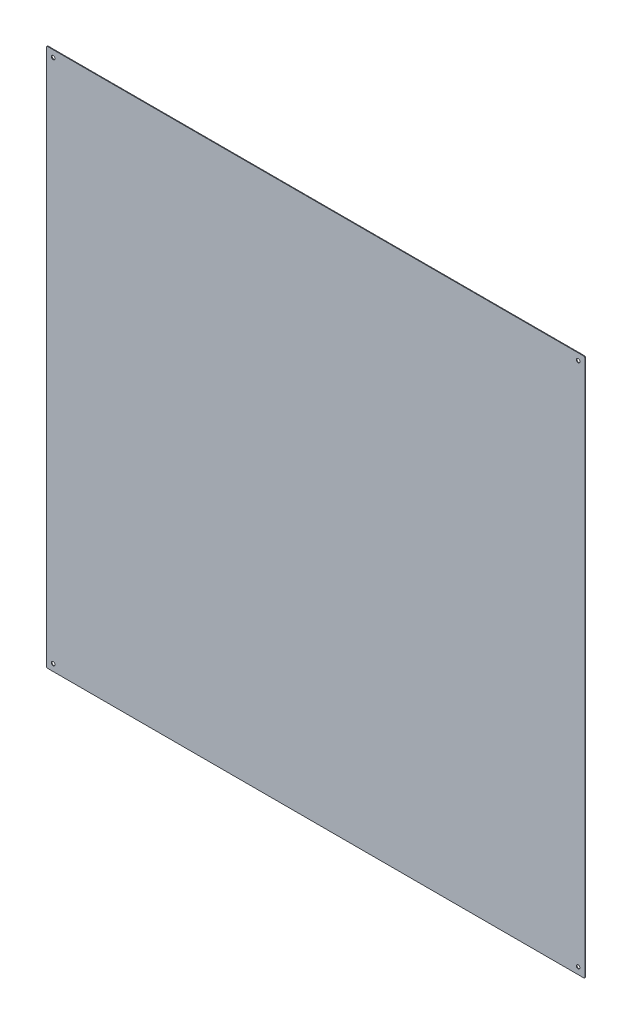
ISO-10303-21;
HEADER;
FILE_DESCRIPTION(('STEP AP214'),'2;1');
FILE_NAME('part.step','',(''),(''),'','','');
FILE_SCHEMA(('AUTOMOTIVE_DESIGN { 1 0 10303 214 1 1 1 1 }'));
ENDSEC;
DATA;
#1=APPLICATION_CONTEXT('core data for automotive mechanical design processes');
#2=APPLICATION_PROTOCOL_DEFINITION('international standard','automotive_design',2000,#1);
#3=PRODUCT_CONTEXT('',#1,'mechanical');
#4=PRODUCT('Part','Part','',(#3));
#5=PRODUCT_RELATED_PRODUCT_CATEGORY('part','',(#4));
#6=PRODUCT_DEFINITION_FORMATION('','',#4);
#7=PRODUCT_DEFINITION_CONTEXT('part definition',#1,'design');
#8=PRODUCT_DEFINITION('design','',#6,#7);
#9=PRODUCT_DEFINITION_SHAPE('','',#8);
#10=(LENGTH_UNIT() NAMED_UNIT(*) SI_UNIT(.MILLI.,.METRE.));
#11=(NAMED_UNIT(*) PLANE_ANGLE_UNIT() SI_UNIT($,.RADIAN.));
#12=(NAMED_UNIT(*) SI_UNIT($,.STERADIAN.) SOLID_ANGLE_UNIT());
#13=UNCERTAINTY_MEASURE_WITH_UNIT(LENGTH_MEASURE(1.E-05),#10,'distance_accuracy_value','');
#14=(GEOMETRIC_REPRESENTATION_CONTEXT(3) GLOBAL_UNCERTAINTY_ASSIGNED_CONTEXT((#13)) GLOBAL_UNIT_ASSIGNED_CONTEXT((#10,
#11,#12)) REPRESENTATION_CONTEXT('',''));
#15=CARTESIAN_POINT('',(0.,0.,0.));
#16=DIRECTION('',(0.,0.,1.));
#17=DIRECTION('',(1.,0.,0.));
#18=AXIS2_PLACEMENT_3D('',#15,#16,#17);
#19=CARTESIAN_POINT('',(602.500000000001,602.5,7.50000000000006));
#20=DIRECTION('',(-1.,0.,0.));
#21=DIRECTION('',(0.,-1.,0.));
#22=AXIS2_PLACEMENT_3D('',#19,#20,#21);
#23=PLANE('',#22);
#24=DIRECTION('',(0.,1.,0.));
#25=VECTOR('',#24,1.);
#26=CARTESIAN_POINT('',(602.500000000001,602.5,6.00000000000001));
#27=LINE('',#26,#25);
#28=CARTESIAN_POINT('',(602.500000000001,-599.5,6.00000000000001));
#29=VERTEX_POINT('',#28);
#30=CARTESIAN_POINT('',(602.500000000001,599.5,6.00000000000001));
#31=VERTEX_POINT('',#30);
#32=EDGE_CURVE('E131',#29,#31,#27,.T.);
#33=ORIENTED_EDGE('',*,*,#32,.T.);
#34=DIRECTION('',(0.,0.,-1.));
#35=VECTOR('',#34,1.);
#36=CARTESIAN_POINT('',(602.500000000001,599.5,7.50000000000006));
#37=LINE('',#36,#35);
#38=CARTESIAN_POINT('',(602.500000000001,599.5,7.50000000000006));
#39=VERTEX_POINT('',#38);
#40=EDGE_CURVE('E154',#31,#39,#37,.F.);
#41=ORIENTED_EDGE('',*,*,#40,.T.);
#42=DIRECTION('',(0.,1.,0.));
#43=VECTOR('',#42,1.);
#44=CARTESIAN_POINT('',(602.500000000001,602.5,7.50000000000006));
#45=LINE('',#44,#43);
#46=CARTESIAN_POINT('',(602.500000000001,-599.5,7.50000000000006));
#47=VERTEX_POINT('',#46);
#48=EDGE_CURVE('E129',#47,#39,#45,.T.);
#49=ORIENTED_EDGE('',*,*,#48,.F.);
#50=DIRECTION('',(0.,0.,-1.));
#51=VECTOR('',#50,1.);
#52=CARTESIAN_POINT('',(602.500000000001,-599.5,7.50000000000006));
#53=LINE('',#52,#51);
#54=EDGE_CURVE('E151',#47,#29,#53,.T.);
#55=ORIENTED_EDGE('',*,*,#54,.T.);
#56=EDGE_LOOP('',(#33,#41,#49,#55));
#57=FACE_BOUND('',#56,.T.);
#58=ADVANCED_FACE('F36',(#57),#23,.F.);
#59=CARTESIAN_POINT('',(-602.5,602.5,7.50000000000006));
#60=DIRECTION('',(0.,-1.,0.));
#61=DIRECTION('',(1.,0.,0.));
#62=AXIS2_PLACEMENT_3D('',#59,#60,#61);
#63=PLANE('',#62);
#64=DIRECTION('',(-1.,0.,0.));
#65=VECTOR('',#64,1.);
#66=CARTESIAN_POINT('',(-602.5,602.5,6.00000000000001));
#67=LINE('',#66,#65);
#68=CARTESIAN_POINT('',(599.500000000001,602.5,6.00000000000001));
#69=VERTEX_POINT('',#68);
#70=CARTESIAN_POINT('',(-599.5,602.5,6.00000000000001));
#71=VERTEX_POINT('',#70);
#72=EDGE_CURVE('E127',#69,#71,#67,.T.);
#73=ORIENTED_EDGE('',*,*,#72,.T.);
#74=DIRECTION('',(0.,0.,-1.));
#75=VECTOR('',#74,1.);
#76=CARTESIAN_POINT('',(-599.5,602.5,7.50000000000006));
#77=LINE('',#76,#75);
#78=CARTESIAN_POINT('',(-599.5,602.5,7.50000000000006));
#79=VERTEX_POINT('',#78);
#80=EDGE_CURVE('E106',#71,#79,#77,.F.);
#81=ORIENTED_EDGE('',*,*,#80,.T.);
#82=DIRECTION('',(-1.,0.,0.));
#83=VECTOR('',#82,1.);
#84=CARTESIAN_POINT('',(-602.5,602.5,7.50000000000006));
#85=LINE('',#84,#83);
#86=CARTESIAN_POINT('',(599.500000000001,602.5,7.50000000000006));
#87=VERTEX_POINT('',#86);
#88=EDGE_CURVE('E170',#87,#79,#85,.T.);
#89=ORIENTED_EDGE('',*,*,#88,.F.);
#90=DIRECTION('',(0.,0.,-1.));
#91=VECTOR('',#90,1.);
#92=CARTESIAN_POINT('',(599.500000000001,602.5,7.50000000000006));
#93=LINE('',#92,#91);
#94=EDGE_CURVE('E111',#87,#69,#93,.T.);
#95=ORIENTED_EDGE('',*,*,#94,.T.);
#96=EDGE_LOOP('',(#73,#81,#89,#95));
#97=FACE_BOUND('',#96,.T.);
#98=ADVANCED_FACE('F229',(#97),#63,.F.);
#99=CARTESIAN_POINT('',(-602.5,602.5,7.50000000000006));
#100=DIRECTION('',(1.,0.,0.));
#101=DIRECTION('',(0.,1.,0.));
#102=AXIS2_PLACEMENT_3D('',#99,#100,#101);
#103=PLANE('',#102);
#104=DIRECTION('',(0.,-1.,0.));
#105=VECTOR('',#104,1.);
#106=CARTESIAN_POINT('',(-602.5,602.5,7.50000000000006));
#107=LINE('',#106,#105);
#108=CARTESIAN_POINT('',(-602.5,599.5,7.50000000000006));
#109=VERTEX_POINT('',#108);
#110=CARTESIAN_POINT('',(-602.499999999999,-599.5,7.50000000000006));
#111=VERTEX_POINT('',#110);
#112=EDGE_CURVE('E120',#109,#111,#107,.T.);
#113=ORIENTED_EDGE('',*,*,#112,.F.);
#114=DIRECTION('',(0.,0.,-1.));
#115=VECTOR('',#114,1.);
#116=CARTESIAN_POINT('',(-602.5,599.5,7.50000000000006));
#117=LINE('',#116,#115);
#118=CARTESIAN_POINT('',(-602.5,599.5,6.00000000000001));
#119=VERTEX_POINT('',#118);
#120=EDGE_CURVE('E105',#109,#119,#117,.T.);
#121=ORIENTED_EDGE('',*,*,#120,.T.);
#122=DIRECTION('',(0.,-1.,0.));
#123=VECTOR('',#122,1.);
#124=CARTESIAN_POINT('',(-602.5,602.5,6.00000000000001));
#125=LINE('',#124,#123);
#126=CARTESIAN_POINT('',(-602.499999999999,-599.5,6.00000000000001));
#127=VERTEX_POINT('',#126);
#128=EDGE_CURVE('E118',#119,#127,#125,.T.);
#129=ORIENTED_EDGE('',*,*,#128,.T.);
#130=DIRECTION('',(0.,0.,-1.));
#131=VECTOR('',#130,1.);
#132=CARTESIAN_POINT('',(-602.499999999999,-599.5,7.50000000000006));
#133=LINE('',#132,#131);
#134=EDGE_CURVE('E122',#127,#111,#133,.F.);
#135=ORIENTED_EDGE('',*,*,#134,.T.);
#136=EDGE_LOOP('',(#113,#121,#129,#135));
#137=FACE_BOUND('',#136,.T.);
#138=ADVANCED_FACE('F117',(#137),#103,.F.);
#139=CARTESIAN_POINT('',(-602.499999999999,-602.5,7.50000000000006));
#140=DIRECTION('',(0.,1.,0.));
#141=DIRECTION('',(0.,0.,1.));
#142=AXIS2_PLACEMENT_3D('',#139,#140,#141);
#143=PLANE('',#142);
#144=DIRECTION('',(1.,0.,0.));
#145=VECTOR('',#144,1.);
#146=CARTESIAN_POINT('',(-602.499999999999,-602.5,6.00000000000001));
#147=LINE('',#146,#145);
#148=CARTESIAN_POINT('',(-599.499999999999,-602.5,6.00000000000001));
#149=VERTEX_POINT('',#148);
#150=CARTESIAN_POINT('',(599.500000000001,-602.5,6.00000000000001));
#151=VERTEX_POINT('',#150);
#152=EDGE_CURVE('E126',#149,#151,#147,.T.);
#153=ORIENTED_EDGE('',*,*,#152,.T.);
#154=DIRECTION('',(0.,0.,-1.));
#155=VECTOR('',#154,1.);
#156=CARTESIAN_POINT('',(599.500000000001,-602.5,7.50000000000006));
#157=LINE('',#156,#155);
#158=CARTESIAN_POINT('',(599.500000000001,-602.5,7.50000000000006));
#159=VERTEX_POINT('',#158);
#160=EDGE_CURVE('E11',#151,#159,#157,.F.);
#161=ORIENTED_EDGE('',*,*,#160,.T.);
#162=DIRECTION('',(1.,0.,0.));
#163=VECTOR('',#162,1.);
#164=CARTESIAN_POINT('',(-602.499999999999,-602.5,7.50000000000006));
#165=LINE('',#164,#163);
#166=CARTESIAN_POINT('',(-599.499999999999,-602.5,7.50000000000006));
#167=VERTEX_POINT('',#166);
#168=EDGE_CURVE('E135',#167,#159,#165,.T.);
#169=ORIENTED_EDGE('',*,*,#168,.F.);
#170=DIRECTION('',(0.,0.,-1.));
#171=VECTOR('',#170,1.);
#172=CARTESIAN_POINT('',(-599.499999999999,-602.5,7.50000000000006));
#173=LINE('',#172,#171);
#174=EDGE_CURVE('E44',#167,#149,#173,.T.);
#175=ORIENTED_EDGE('',*,*,#174,.T.);
#176=EDGE_LOOP('',(#153,#161,#169,#175));
#177=FACE_BOUND('',#176,.T.);
#178=ADVANCED_FACE('F157',(#177),#143,.F.);
#179=CARTESIAN_POINT('',(0.,0.,7.50000000000006));
#180=DIRECTION('',(0.,0.,1.));
#181=DIRECTION('',(1.,0.,0.));
#182=AXIS2_PLACEMENT_3D('',#179,#180,#181);
#183=PLANE('',#182);
#184=CARTESIAN_POINT('',(-587.322330470337,587.322330470336,7.50000000000006));
#185=DIRECTION('',(0.,0.,-1.));
#186=DIRECTION('',(-1.,0.,0.));
#187=AXIS2_PLACEMENT_3D('',#184,#185,#186);
#188=CIRCLE('',#187,3.99999999999999);
#189=CARTESIAN_POINT('',(-591.322330470337,587.322330470336,7.50000000000006));
#190=VERTEX_POINT('',#189);
#191=EDGE_CURVE('E189',#190,#190,#188,.T.);
#192=ORIENTED_EDGE('',*,*,#191,.T.);
#193=EDGE_LOOP('',(#192));
#194=FACE_BOUND('',#193,.T.);
#195=CARTESIAN_POINT('',(587.32233047033,587.322330470342,7.50000000000006));
#196=DIRECTION('',(0.,0.,-1.));
#197=DIRECTION('',(-1.,0.,0.));
#198=AXIS2_PLACEMENT_3D('',#195,#196,#197);
#199=CIRCLE('',#198,3.99999999999999);
#200=CARTESIAN_POINT('',(583.32233047033,587.322330470342,7.50000000000006));
#201=VERTEX_POINT('',#200);
#202=EDGE_CURVE('E195',#201,#201,#199,.T.);
#203=ORIENTED_EDGE('',*,*,#202,.T.);
#204=EDGE_LOOP('',(#203));
#205=FACE_BOUND('',#204,.T.);
#206=CARTESIAN_POINT('',(587.32233047034,-587.322330470332,7.50000000000006));
#207=DIRECTION('',(0.,0.,-1.));
#208=DIRECTION('',(-1.,0.,0.));
#209=AXIS2_PLACEMENT_3D('',#206,#207,#208);
#210=CIRCLE('',#209,3.99999999999999);
#211=CARTESIAN_POINT('',(583.32233047034,-587.322330470332,7.50000000000006));
#212=VERTEX_POINT('',#211);
#213=EDGE_CURVE('E184',#212,#212,#210,.T.);
#214=ORIENTED_EDGE('',*,*,#213,.T.);
#215=EDGE_LOOP('',(#214));
#216=FACE_BOUND('',#215,.T.);
#217=CARTESIAN_POINT('',(-587.322330470334,-587.322330470338,7.50000000000006));
#218=DIRECTION('',(0.,0.,-1.));
#219=DIRECTION('',(-1.,0.,0.));
#220=AXIS2_PLACEMENT_3D('',#217,#218,#219);
#221=CIRCLE('',#220,3.99999999999999);
#222=CARTESIAN_POINT('',(-591.322330470334,-587.322330470338,7.50000000000006));
#223=VERTEX_POINT('',#222);
#224=EDGE_CURVE('E179',#223,#223,#221,.T.);
#225=ORIENTED_EDGE('',*,*,#224,.T.);
#226=EDGE_LOOP('',(#225));
#227=FACE_BOUND('',#226,.T.);
#228=ORIENTED_EDGE('',*,*,#88,.T.);
#229=CARTESIAN_POINT('',(-599.5,599.5,7.50000000000006));
#230=DIRECTION('',(0.,0.,1.));
#231=DIRECTION('',(1.,0.,0.));
#232=AXIS2_PLACEMENT_3D('',#229,#230,#231);
#233=CIRCLE('',#232,3.);
#234=EDGE_CURVE('E149',#79,#109,#233,.T.);
#235=ORIENTED_EDGE('',*,*,#234,.T.);
#236=ORIENTED_EDGE('',*,*,#112,.T.);
#237=CARTESIAN_POINT('',(-599.499999999999,-599.5,7.50000000000006));
#238=DIRECTION('',(0.,0.,1.));
#239=DIRECTION('',(1.,0.,0.));
#240=AXIS2_PLACEMENT_3D('',#237,#238,#239);
#241=CIRCLE('',#240,3.);
#242=EDGE_CURVE('E56',#111,#167,#241,.T.);
#243=ORIENTED_EDGE('',*,*,#242,.T.);
#244=ORIENTED_EDGE('',*,*,#168,.T.);
#245=CARTESIAN_POINT('',(599.500000000001,-599.5,7.50000000000006));
#246=DIRECTION('',(0.,0.,1.));
#247=DIRECTION('',(1.,0.,0.));
#248=AXIS2_PLACEMENT_3D('',#245,#246,#247);
#249=CIRCLE('',#248,3.);
#250=EDGE_CURVE('E145',#159,#47,#249,.T.);
#251=ORIENTED_EDGE('',*,*,#250,.T.);
#252=ORIENTED_EDGE('',*,*,#48,.T.);
#253=CARTESIAN_POINT('',(599.500000000001,599.5,7.50000000000006));
#254=DIRECTION('',(0.,0.,1.));
#255=DIRECTION('',(1.,0.,0.));
#256=AXIS2_PLACEMENT_3D('',#253,#254,#255);
#257=CIRCLE('',#256,3.);
#258=EDGE_CURVE('E147',#39,#87,#257,.T.);
#259=ORIENTED_EDGE('',*,*,#258,.T.);
#260=EDGE_LOOP('',(#228,#235,#236,#243,#244,#251,#252,#259));
#261=FACE_BOUND('',#260,.T.);
#262=ADVANCED_FACE('F204',(#194,#205,#216,#227,#261),#183,.T.);
#263=CARTESIAN_POINT('',(0.,0.,6.00000000000001));
#264=DIRECTION('',(0.,0.,1.));
#265=DIRECTION('',(1.,0.,0.));
#266=AXIS2_PLACEMENT_3D('',#263,#264,#265);
#267=PLANE('',#266);
#268=CARTESIAN_POINT('',(-587.322330470337,587.322330470336,6.00000000000001));
#269=DIRECTION('',(0.,0.,-1.));
#270=DIRECTION('',(-1.,0.,0.));
#271=AXIS2_PLACEMENT_3D('',#268,#269,#270);
#272=CIRCLE('',#271,3.99999999999999);
#273=CARTESIAN_POINT('',(-591.322330470337,587.322330470336,6.00000000000001));
#274=VERTEX_POINT('',#273);
#275=EDGE_CURVE('E186',#274,#274,#272,.T.);
#276=ORIENTED_EDGE('',*,*,#275,.F.);
#277=EDGE_LOOP('',(#276));
#278=FACE_BOUND('',#277,.T.);
#279=CARTESIAN_POINT('',(587.32233047033,587.322330470342,6.00000000000001));
#280=DIRECTION('',(0.,0.,-1.));
#281=DIRECTION('',(-1.,0.,0.));
#282=AXIS2_PLACEMENT_3D('',#279,#280,#281);
#283=CIRCLE('',#282,3.99999999999999);
#284=CARTESIAN_POINT('',(583.32233047033,587.322330470342,6.00000000000001));
#285=VERTEX_POINT('',#284);
#286=EDGE_CURVE('E192',#285,#285,#283,.T.);
#287=ORIENTED_EDGE('',*,*,#286,.F.);
#288=EDGE_LOOP('',(#287));
#289=FACE_BOUND('',#288,.T.);
#290=CARTESIAN_POINT('',(587.32233047034,-587.322330470332,6.00000000000001));
#291=DIRECTION('',(0.,0.,-1.));
#292=DIRECTION('',(-1.,0.,0.));
#293=AXIS2_PLACEMENT_3D('',#290,#291,#292);
#294=CIRCLE('',#293,3.99999999999999);
#295=CARTESIAN_POINT('',(583.32233047034,-587.322330470332,6.00000000000001));
#296=VERTEX_POINT('',#295);
#297=EDGE_CURVE('E198',#296,#296,#294,.T.);
#298=ORIENTED_EDGE('',*,*,#297,.F.);
#299=EDGE_LOOP('',(#298));
#300=FACE_BOUND('',#299,.T.);
#301=CARTESIAN_POINT('',(-587.322330470334,-587.322330470338,6.00000000000001));
#302=DIRECTION('',(0.,0.,-1.));
#303=DIRECTION('',(-1.,0.,0.));
#304=AXIS2_PLACEMENT_3D('',#301,#302,#303);
#305=CIRCLE('',#304,3.99999999999999);
#306=CARTESIAN_POINT('',(-591.322330470334,-587.322330470338,6.00000000000001));
#307=VERTEX_POINT('',#306);
#308=EDGE_CURVE('E175',#307,#307,#305,.T.);
#309=ORIENTED_EDGE('',*,*,#308,.F.);
#310=EDGE_LOOP('',(#309));
#311=FACE_BOUND('',#310,.T.);
#312=ORIENTED_EDGE('',*,*,#128,.F.);
#313=CARTESIAN_POINT('',(-599.5,599.5,6.00000000000001));
#314=DIRECTION('',(0.,0.,1.));
#315=DIRECTION('',(1.,0.,0.));
#316=AXIS2_PLACEMENT_3D('',#313,#314,#315);
#317=CIRCLE('',#316,3.);
#318=EDGE_CURVE('E101',#119,#71,#317,.F.);
#319=ORIENTED_EDGE('',*,*,#318,.T.);
#320=ORIENTED_EDGE('',*,*,#72,.F.);
#321=CARTESIAN_POINT('',(599.500000000001,599.5,6.00000000000001));
#322=DIRECTION('',(0.,0.,1.));
#323=DIRECTION('',(1.,0.,0.));
#324=AXIS2_PLACEMENT_3D('',#321,#322,#323);
#325=CIRCLE('',#324,3.);
#326=EDGE_CURVE('E112',#69,#31,#325,.F.);
#327=ORIENTED_EDGE('',*,*,#326,.T.);
#328=ORIENTED_EDGE('',*,*,#32,.F.);
#329=CARTESIAN_POINT('',(599.500000000001,-599.5,6.00000000000001));
#330=DIRECTION('',(0.,0.,1.));
#331=DIRECTION('',(1.,0.,0.));
#332=AXIS2_PLACEMENT_3D('',#329,#330,#331);
#333=CIRCLE('',#332,3.);
#334=EDGE_CURVE('E138',#29,#151,#333,.F.);
#335=ORIENTED_EDGE('',*,*,#334,.T.);
#336=ORIENTED_EDGE('',*,*,#152,.F.);
#337=CARTESIAN_POINT('',(-599.499999999999,-599.5,6.00000000000001));
#338=DIRECTION('',(0.,0.,1.));
#339=DIRECTION('',(1.,0.,0.));
#340=AXIS2_PLACEMENT_3D('',#337,#338,#339);
#341=CIRCLE('',#340,3.);
#342=EDGE_CURVE('E121',#149,#127,#341,.F.);
#343=ORIENTED_EDGE('',*,*,#342,.T.);
#344=EDGE_LOOP('',(#312,#319,#320,#327,#328,#335,#336,#343));
#345=FACE_BOUND('',#344,.T.);
#346=ADVANCED_FACE('F124',(#278,#289,#300,#311,#345),#267,.F.);
#347=CARTESIAN_POINT('',(-599.5,599.5,7.50000000000006));
#348=DIRECTION('',(0.,0.,-1.));
#349=DIRECTION('',(-1.,0.,0.));
#350=AXIS2_PLACEMENT_3D('',#347,#348,#349);
#351=CYLINDRICAL_SURFACE('',#350,3.);
#352=ORIENTED_EDGE('',*,*,#234,.F.);
#353=ORIENTED_EDGE('',*,*,#80,.F.);
#354=ORIENTED_EDGE('',*,*,#318,.F.);
#355=ORIENTED_EDGE('',*,*,#120,.F.);
#356=EDGE_LOOP('',(#352,#353,#354,#355));
#357=FACE_BOUND('',#356,.T.);
#358=ADVANCED_FACE('F104',(#357),#351,.T.);
#359=CARTESIAN_POINT('',(599.500000000001,599.5,7.50000000000006));
#360=DIRECTION('',(0.,0.,-1.));
#361=DIRECTION('',(-1.,0.,0.));
#362=AXIS2_PLACEMENT_3D('',#359,#360,#361);
#363=CYLINDRICAL_SURFACE('',#362,3.);
#364=ORIENTED_EDGE('',*,*,#258,.F.);
#365=ORIENTED_EDGE('',*,*,#40,.F.);
#366=ORIENTED_EDGE('',*,*,#326,.F.);
#367=ORIENTED_EDGE('',*,*,#94,.F.);
#368=EDGE_LOOP('',(#364,#365,#366,#367));
#369=FACE_BOUND('',#368,.T.);
#370=ADVANCED_FACE('F240',(#369),#363,.T.);
#371=CARTESIAN_POINT('',(599.500000000001,-599.5,7.50000000000006));
#372=DIRECTION('',(0.,0.,-1.));
#373=DIRECTION('',(-1.,0.,0.));
#374=AXIS2_PLACEMENT_3D('',#371,#372,#373);
#375=CYLINDRICAL_SURFACE('',#374,3.);
#376=ORIENTED_EDGE('',*,*,#250,.F.);
#377=ORIENTED_EDGE('',*,*,#160,.F.);
#378=ORIENTED_EDGE('',*,*,#334,.F.);
#379=ORIENTED_EDGE('',*,*,#54,.F.);
#380=EDGE_LOOP('',(#376,#377,#378,#379));
#381=FACE_BOUND('',#380,.T.);
#382=ADVANCED_FACE('F164',(#381),#375,.T.);
#383=CARTESIAN_POINT('',(-599.499999999999,-599.5,7.50000000000006));
#384=DIRECTION('',(0.,0.,-1.));
#385=DIRECTION('',(-1.,0.,0.));
#386=AXIS2_PLACEMENT_3D('',#383,#384,#385);
#387=CYLINDRICAL_SURFACE('',#386,3.);
#388=ORIENTED_EDGE('',*,*,#242,.F.);
#389=ORIENTED_EDGE('',*,*,#134,.F.);
#390=ORIENTED_EDGE('',*,*,#342,.F.);
#391=ORIENTED_EDGE('',*,*,#174,.F.);
#392=EDGE_LOOP('',(#388,#389,#390,#391));
#393=FACE_BOUND('',#392,.T.);
#394=ADVANCED_FACE('F38',(#393),#387,.T.);
#395=CARTESIAN_POINT('',(-587.322330470334,-587.322330470338,7.50000000000006));
#396=DIRECTION('',(0.,0.,-1.));
#397=DIRECTION('',(-1.,0.,0.));
#398=AXIS2_PLACEMENT_3D('',#395,#396,#397);
#399=CYLINDRICAL_SURFACE('',#398,3.99999999999999);
#400=ORIENTED_EDGE('',*,*,#224,.F.);
#401=EDGE_LOOP('',(#400));
#402=FACE_BOUND('',#401,.T.);
#403=ORIENTED_EDGE('',*,*,#308,.T.);
#404=EDGE_LOOP('',(#403));
#405=FACE_BOUND('',#404,.T.);
#406=ADVANCED_FACE('F210',(#402,#405),#399,.F.);
#407=CARTESIAN_POINT('',(587.32233047034,-587.322330470332,7.50000000000006));
#408=DIRECTION('',(0.,0.,-1.));
#409=DIRECTION('',(-1.,0.,0.));
#410=AXIS2_PLACEMENT_3D('',#407,#408,#409);
#411=CYLINDRICAL_SURFACE('',#410,3.99999999999999);
#412=ORIENTED_EDGE('',*,*,#213,.F.);
#413=EDGE_LOOP('',(#412));
#414=FACE_BOUND('',#413,.T.);
#415=ORIENTED_EDGE('',*,*,#297,.T.);
#416=EDGE_LOOP('',(#415));
#417=FACE_BOUND('',#416,.T.);
#418=ADVANCED_FACE('F206',(#414,#417),#411,.F.);
#419=CARTESIAN_POINT('',(587.32233047033,587.322330470342,7.50000000000006));
#420=DIRECTION('',(0.,0.,-1.));
#421=DIRECTION('',(-1.,0.,0.));
#422=AXIS2_PLACEMENT_3D('',#419,#420,#421);
#423=CYLINDRICAL_SURFACE('',#422,3.99999999999999);
#424=ORIENTED_EDGE('',*,*,#202,.F.);
#425=EDGE_LOOP('',(#424));
#426=FACE_BOUND('',#425,.T.);
#427=ORIENTED_EDGE('',*,*,#286,.T.);
#428=EDGE_LOOP('',(#427));
#429=FACE_BOUND('',#428,.T.);
#430=ADVANCED_FACE('F209',(#426,#429),#423,.F.);
#431=CARTESIAN_POINT('',(-587.322330470337,587.322330470336,7.50000000000006));
#432=DIRECTION('',(0.,0.,-1.));
#433=DIRECTION('',(-1.,0.,0.));
#434=AXIS2_PLACEMENT_3D('',#431,#432,#433);
#435=CYLINDRICAL_SURFACE('',#434,3.99999999999999);
#436=ORIENTED_EDGE('',*,*,#191,.F.);
#437=EDGE_LOOP('',(#436));
#438=FACE_BOUND('',#437,.T.);
#439=ORIENTED_EDGE('',*,*,#275,.T.);
#440=EDGE_LOOP('',(#439));
#441=FACE_BOUND('',#440,.T.);
#442=ADVANCED_FACE('F271',(#438,#441),#435,.F.);
#443=CLOSED_SHELL('',(#58,#98,#138,#178,#262,#346,#358,#370,#382,#394,#406,#418,#430,#442));
#444=MANIFOLD_SOLID_BREP('B2',#443);
#445=ADVANCED_BREP_SHAPE_REPRESENTATION('',(#18,#444),#14);
#446=SHAPE_DEFINITION_REPRESENTATION(#9,#445);
ENDSEC;
END-ISO-10303-21;
